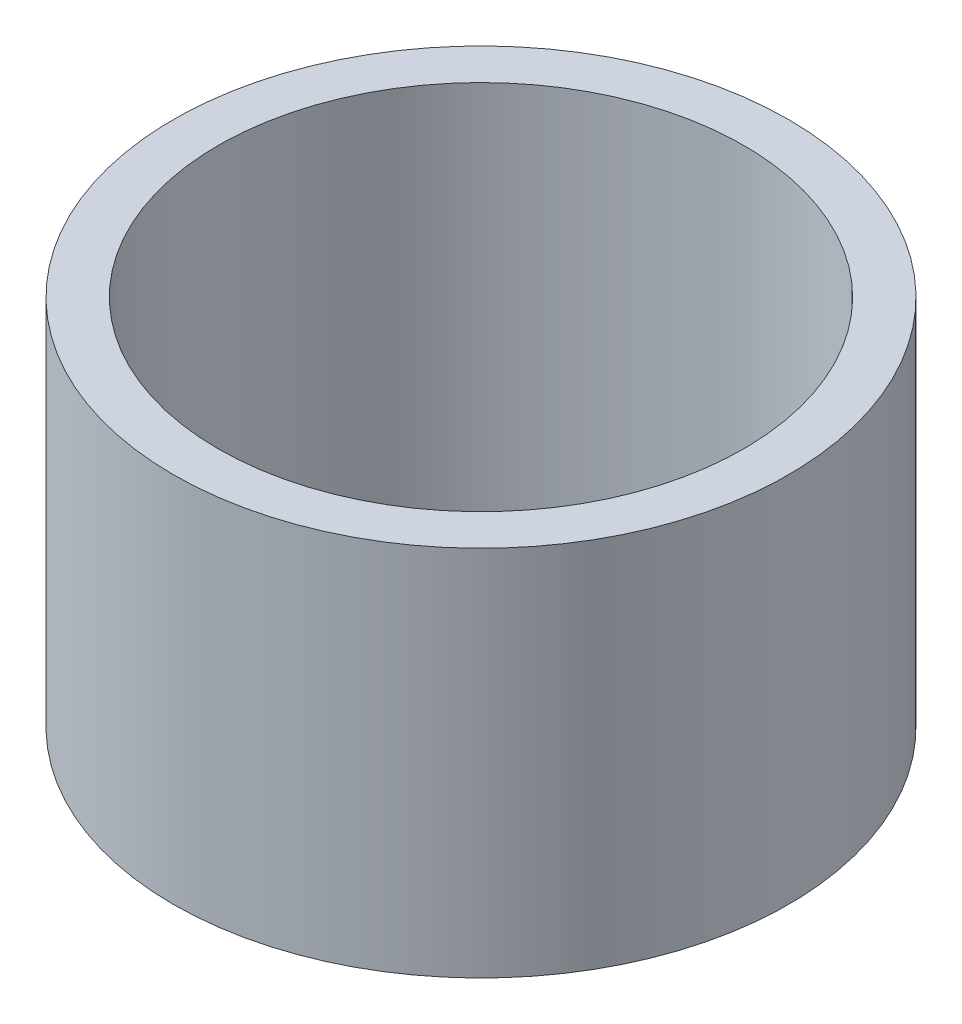
ISO-10303-21;
HEADER;
FILE_DESCRIPTION(('STEP AP214'),'2;1');
FILE_NAME('part.step','',(''),(''),'','','');
FILE_SCHEMA(('AUTOMOTIVE_DESIGN { 1 0 10303 214 1 1 1 1 }'));
ENDSEC;
DATA;
#1=APPLICATION_CONTEXT('core data for automotive mechanical design processes');
#2=APPLICATION_PROTOCOL_DEFINITION('international standard','automotive_design',2000,#1);
#3=PRODUCT_CONTEXT('',#1,'mechanical');
#4=PRODUCT('Part','Part','',(#3));
#5=PRODUCT_RELATED_PRODUCT_CATEGORY('part','',(#4));
#6=PRODUCT_DEFINITION_FORMATION('','',#4);
#7=PRODUCT_DEFINITION_CONTEXT('part definition',#1,'design');
#8=PRODUCT_DEFINITION('design','',#6,#7);
#9=PRODUCT_DEFINITION_SHAPE('','',#8);
#10=(LENGTH_UNIT() NAMED_UNIT(*) SI_UNIT(.MILLI.,.METRE.));
#11=(NAMED_UNIT(*) PLANE_ANGLE_UNIT() SI_UNIT($,.RADIAN.));
#12=(NAMED_UNIT(*) SI_UNIT($,.STERADIAN.) SOLID_ANGLE_UNIT());
#13=UNCERTAINTY_MEASURE_WITH_UNIT(LENGTH_MEASURE(1.E-05),#10,'distance_accuracy_value','');
#14=(GEOMETRIC_REPRESENTATION_CONTEXT(3) GLOBAL_UNCERTAINTY_ASSIGNED_CONTEXT((#13)) GLOBAL_UNIT_ASSIGNED_CONTEXT((#10,
#11,#12)) REPRESENTATION_CONTEXT('',''));
#15=CARTESIAN_POINT('',(0.,0.,0.));
#16=DIRECTION('',(0.,0.,1.));
#17=DIRECTION('',(1.,0.,0.));
#18=AXIS2_PLACEMENT_3D('',#15,#16,#17);
#19=CARTESIAN_POINT('',(0.,24.1981897901131,0.));
#20=DIRECTION('',(0.,-1.,0.));
#21=DIRECTION('',(0.,0.,-1.));
#22=AXIS2_PLACEMENT_3D('',#19,#20,#21);
#23=CYLINDRICAL_SURFACE('',#22,20.);
#24=CARTESIAN_POINT('',(0.,24.1981897901131,0.));
#25=DIRECTION('',(0.,1.,0.));
#26=DIRECTION('',(0.,0.,1.));
#27=AXIS2_PLACEMENT_3D('',#24,#25,#26);
#28=CIRCLE('',#27,20.);
#29=CARTESIAN_POINT('',(0.,24.1981897901131,20.));
#30=VERTEX_POINT('',#29);
#31=EDGE_CURVE('E10',#30,#30,#28,.T.);
#32=ORIENTED_EDGE('',*,*,#31,.F.);
#33=EDGE_LOOP('',(#32));
#34=FACE_BOUND('',#33,.T.);
#35=CARTESIAN_POINT('',(0.,0.,0.));
#36=DIRECTION('',(0.,1.,0.));
#37=DIRECTION('',(0.,0.,1.));
#38=AXIS2_PLACEMENT_3D('',#35,#36,#37);
#39=CIRCLE('',#38,20.);
#40=CARTESIAN_POINT('',(0.,0.,20.));
#41=VERTEX_POINT('',#40);
#42=EDGE_CURVE('E37',#41,#41,#39,.T.);
#43=ORIENTED_EDGE('',*,*,#42,.T.);
#44=EDGE_LOOP('',(#43));
#45=FACE_BOUND('',#44,.T.);
#46=ADVANCED_FACE('F40',(#34,#45),#23,.T.);
#47=CARTESIAN_POINT('',(0.,24.1981897901131,0.));
#48=DIRECTION('',(0.,1.,0.));
#49=DIRECTION('',(0.,0.,1.));
#50=AXIS2_PLACEMENT_3D('',#47,#48,#49);
#51=PLANE('',#50);
#52=CARTESIAN_POINT('',(0.,24.1981897901131,0.));
#53=DIRECTION('',(0.,1.,0.));
#54=DIRECTION('',(0.,0.,1.));
#55=AXIS2_PLACEMENT_3D('',#52,#53,#54);
#56=CIRCLE('',#55,17.0872368701845);
#57=CARTESIAN_POINT('',(0.,24.1981897901131,17.0872368701845));
#58=VERTEX_POINT('',#57);
#59=EDGE_CURVE('E50',#58,#58,#56,.T.);
#60=ORIENTED_EDGE('',*,*,#59,.F.);
#61=EDGE_LOOP('',(#60));
#62=FACE_BOUND('',#61,.T.);
#63=ORIENTED_EDGE('',*,*,#31,.T.);
#64=EDGE_LOOP('',(#63));
#65=FACE_BOUND('',#64,.T.);
#66=ADVANCED_FACE('F59',(#62,#65),#51,.T.);
#67=CARTESIAN_POINT('',(0.,0.,0.));
#68=DIRECTION('',(0.,1.,0.));
#69=DIRECTION('',(0.,0.,1.));
#70=AXIS2_PLACEMENT_3D('',#67,#68,#69);
#71=PLANE('',#70);
#72=CARTESIAN_POINT('',(0.,0.,0.));
#73=DIRECTION('',(0.,1.,0.));
#74=DIRECTION('',(0.,0.,1.));
#75=AXIS2_PLACEMENT_3D('',#72,#73,#74);
#76=CIRCLE('',#75,17.0872368701845);
#77=CARTESIAN_POINT('',(0.,0.,17.0872368701845));
#78=VERTEX_POINT('',#77);
#79=EDGE_CURVE('E47',#78,#78,#76,.T.);
#80=ORIENTED_EDGE('',*,*,#79,.T.);
#81=EDGE_LOOP('',(#80));
#82=FACE_BOUND('',#81,.T.);
#83=ORIENTED_EDGE('',*,*,#42,.F.);
#84=EDGE_LOOP('',(#83));
#85=FACE_BOUND('',#84,.T.);
#86=ADVANCED_FACE('F58',(#82,#85),#71,.F.);
#87=CARTESIAN_POINT('',(0.,24.1981897901131,0.));
#88=DIRECTION('',(0.,-1.,0.));
#89=DIRECTION('',(0.,0.,-1.));
#90=AXIS2_PLACEMENT_3D('',#87,#88,#89);
#91=CYLINDRICAL_SURFACE('',#90,17.0872368701845);
#92=ORIENTED_EDGE('',*,*,#59,.T.);
#93=EDGE_LOOP('',(#92));
#94=FACE_BOUND('',#93,.T.);
#95=ORIENTED_EDGE('',*,*,#79,.F.);
#96=EDGE_LOOP('',(#95));
#97=FACE_BOUND('',#96,.T.);
#98=ADVANCED_FACE('F54',(#94,#97),#91,.F.);
#99=CLOSED_SHELL('',(#46,#66,#86,#98));
#100=MANIFOLD_SOLID_BREP('B2',#99);
#101=ADVANCED_BREP_SHAPE_REPRESENTATION('',(#18,#100),#14);
#102=SHAPE_DEFINITION_REPRESENTATION(#9,#101);
ENDSEC;
END-ISO-10303-21;
